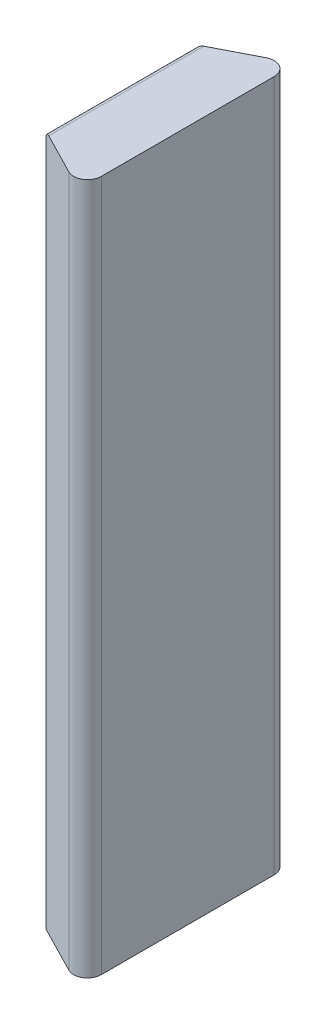
ISO-10303-21;
HEADER;
FILE_DESCRIPTION(('STEP AP214'),'2;1');
FILE_NAME('part.step','',(''),(''),'','','');
FILE_SCHEMA(('AUTOMOTIVE_DESIGN { 1 0 10303 214 1 1 1 1 }'));
ENDSEC;
DATA;
#1=APPLICATION_CONTEXT('core data for automotive mechanical design processes');
#2=APPLICATION_PROTOCOL_DEFINITION('international standard','automotive_design',2000,#1);
#3=PRODUCT_CONTEXT('',#1,'mechanical');
#4=PRODUCT('Part','Part','',(#3));
#5=PRODUCT_RELATED_PRODUCT_CATEGORY('part','',(#4));
#6=PRODUCT_DEFINITION_FORMATION('','',#4);
#7=PRODUCT_DEFINITION_CONTEXT('part definition',#1,'design');
#8=PRODUCT_DEFINITION('design','',#6,#7);
#9=PRODUCT_DEFINITION_SHAPE('','',#8);
#10=(LENGTH_UNIT() NAMED_UNIT(*) SI_UNIT(.MILLI.,.METRE.));
#11=(NAMED_UNIT(*) PLANE_ANGLE_UNIT() SI_UNIT($,.RADIAN.));
#12=(NAMED_UNIT(*) SI_UNIT($,.STERADIAN.) SOLID_ANGLE_UNIT());
#13=UNCERTAINTY_MEASURE_WITH_UNIT(LENGTH_MEASURE(1.E-05),#10,'distance_accuracy_value','');
#14=(GEOMETRIC_REPRESENTATION_CONTEXT(3) GLOBAL_UNCERTAINTY_ASSIGNED_CONTEXT((#13)) GLOBAL_UNIT_ASSIGNED_CONTEXT((#10,
#11,#12)) REPRESENTATION_CONTEXT('',''));
#15=CARTESIAN_POINT('',(0.,0.,0.));
#16=DIRECTION('',(0.,0.,1.));
#17=DIRECTION('',(1.,0.,0.));
#18=AXIS2_PLACEMENT_3D('',#15,#16,#17);
#19=CARTESIAN_POINT('',(0.399999999999999,24.6,134.));
#20=DIRECTION('',(0.,0.,-1.));
#21=DIRECTION('',(1.,0.,0.));
#22=AXIS2_PLACEMENT_3D('',#19,#20,#21);
#23=CYLINDRICAL_SURFACE('',#22,0.4);
#24=CARTESIAN_POINT('',(0.399999999999999,24.6,86.6089510744199));
#25=DIRECTION('',(0.456970406774729,0.,-0.889481898259959));
#26=DIRECTION('',(-0.889481898259958,0.,-0.456970406774729));
#27=AXIS2_PLACEMENT_3D('',#24,#25,#26);
#28=ELLIPSE('',#27,0.449699989153795,0.4);
#29=CARTESIAN_POINT('',(0.399999999999999,25.,86.6089510744199));
#30=VERTEX_POINT('',#29);
#31=CARTESIAN_POINT('',(0.,24.6,86.4034514874497));
#32=VERTEX_POINT('',#31);
#33=EDGE_CURVE('E379',#30,#32,#28,.F.);
#34=ORIENTED_EDGE('',*,*,#33,.F.);
#35=DIRECTION('',(0.,0.,-1.));
#36=VECTOR('',#35,1.);
#37=CARTESIAN_POINT('',(0.399999999999999,25.,134.));
#38=LINE('',#37,#36);
#39=CARTESIAN_POINT('',(0.399999999999999,25.,75.3910489255801));
#40=VERTEX_POINT('',#39);
#41=EDGE_CURVE('E382',#30,#40,#38,.T.);
#42=ORIENTED_EDGE('',*,*,#41,.T.);
#43=CARTESIAN_POINT('',(0.399999999999999,24.6,75.3910489255801));
#44=DIRECTION('',(0.456970406774729,0.,0.889481898259959));
#45=DIRECTION('',(-0.889481898259959,0.,0.456970406774729));
#46=AXIS2_PLACEMENT_3D('',#43,#44,#45);
#47=ELLIPSE('',#46,0.449699989153795,0.4);
#48=CARTESIAN_POINT('',(0.,24.6,75.5965485125503));
#49=VERTEX_POINT('',#48);
#50=EDGE_CURVE('E344',#49,#40,#47,.F.);
#51=ORIENTED_EDGE('',*,*,#50,.F.);
#52=DIRECTION('',(0.,0.,-1.));
#53=VECTOR('',#52,1.);
#54=CARTESIAN_POINT('',(0.,24.6,134.));
#55=LINE('',#54,#53);
#56=EDGE_CURVE('E384',#49,#32,#55,.F.);
#57=ORIENTED_EDGE('',*,*,#56,.T.);
#58=EDGE_LOOP('',(#34,#42,#51,#57));
#59=FACE_BOUND('',#58,.T.);
#60=ADVANCED_FACE('F277',(#59),#23,.T.);
#61=CARTESIAN_POINT('',(10.,25.,134.));
#62=DIRECTION('',(0.,-1.,0.));
#63=DIRECTION('',(0.,0.,1.));
#64=AXIS2_PLACEMENT_3D('',#61,#62,#63);
#65=PLANE('',#64);
#66=ORIENTED_EDGE('',*,*,#41,.F.);
#67=DIRECTION('',(0.889481898259958,0.,0.456970406774729));
#68=VECTOR('',#67,1.);
#69=CARTESIAN_POINT('',(27.2582022295512,25.,100.407324736757));
#70=LINE('',#69,#68);
#71=CARTESIAN_POINT('',(3.38363041453297,25.,88.1417881190656));
#72=VERTEX_POINT('',#71);
#73=EDGE_CURVE('E299',#30,#72,#70,.T.);
#74=ORIENTED_EDGE('',*,*,#73,.T.);
#75=CARTESIAN_POINT('',(3.84060082130771,25.,87.2523062208056));
#76=DIRECTION('',(0.,-1.,0.));
#77=DIRECTION('',(0.,0.,-1.));
#78=AXIS2_PLACEMENT_3D('',#75,#76,#77);
#79=CIRCLE('',#78,0.999999999999999);
#80=CARTESIAN_POINT('',(4.84060082130771,25.,87.2523062208056));
#81=VERTEX_POINT('',#80);
#82=EDGE_CURVE('E377',#72,#81,#79,.F.);
#83=ORIENTED_EDGE('',*,*,#82,.T.);
#84=DIRECTION('',(0.,0.,-1.));
#85=VECTOR('',#84,1.);
#86=CARTESIAN_POINT('',(4.84060082130771,25.,134.));
#87=LINE('',#86,#85);
#88=CARTESIAN_POINT('',(4.84060082130771,25.,74.7476937791944));
#89=VERTEX_POINT('',#88);
#90=EDGE_CURVE('E363',#81,#89,#87,.T.);
#91=ORIENTED_EDGE('',*,*,#90,.T.);
#92=CARTESIAN_POINT('',(3.84060082130771,25.,74.7476937791943));
#93=DIRECTION('',(0.,-1.,0.));
#94=DIRECTION('',(0.,0.,-1.));
#95=AXIS2_PLACEMENT_3D('',#92,#93,#94);
#96=CIRCLE('',#95,0.999999999999999);
#97=CARTESIAN_POINT('',(3.38363041453297,25.,73.8582118809344));
#98=VERTEX_POINT('',#97);
#99=EDGE_CURVE('E348',#89,#98,#96,.F.);
#100=ORIENTED_EDGE('',*,*,#99,.T.);
#101=DIRECTION('',(-0.889481898259959,0.,0.456970406774729));
#102=VECTOR('',#101,1.);
#103=CARTESIAN_POINT('',(27.2582022295512,25.,61.5926752632428));
#104=LINE('',#103,#102);
#105=EDGE_CURVE('E336',#98,#40,#104,.T.);
#106=ORIENTED_EDGE('',*,*,#105,.T.);
#107=EDGE_LOOP('',(#66,#74,#83,#91,#100,#106));
#108=FACE_BOUND('',#107,.T.);
#109=ADVANCED_FACE('F361',(#108),#65,.F.);
#110=CARTESIAN_POINT('',(0.,-24.99,0.));
#111=DIRECTION('',(0.,1.,0.));
#112=DIRECTION('',(0.,0.,1.));
#113=AXIS2_PLACEMENT_3D('',#110,#111,#112);
#114=PLANE('',#113);
#115=CARTESIAN_POINT('',(3.84060082130771,-24.99,87.2523062208056));
#116=DIRECTION('',(0.,1.,0.));
#117=DIRECTION('',(0.,0.,1.));
#118=AXIS2_PLACEMENT_3D('',#115,#116,#117);
#119=CIRCLE('',#118,0.999999999999999);
#120=CARTESIAN_POINT('',(4.84060082130771,-24.99,87.2523062208056));
#121=VERTEX_POINT('',#120);
#122=CARTESIAN_POINT('',(3.38363041453297,-24.99,88.1417881190656));
#123=VERTEX_POINT('',#122);
#124=EDGE_CURVE('E284',#121,#123,#119,.F.);
#125=ORIENTED_EDGE('',*,*,#124,.T.);
#126=DIRECTION('',(-0.889481898259958,0.,-0.456970406774729));
#127=VECTOR('',#126,1.);
#128=CARTESIAN_POINT('',(-35.1201434958961,-24.99,68.3605140305977));
#129=LINE('',#128,#127);
#130=CARTESIAN_POINT('',(0.,-24.99,86.4034514874497));
#131=VERTEX_POINT('',#130);
#132=EDGE_CURVE('E12',#123,#131,#129,.T.);
#133=ORIENTED_EDGE('',*,*,#132,.T.);
#134=DIRECTION('',(0.,0.,1.));
#135=VECTOR('',#134,1.);
#136=CARTESIAN_POINT('',(0.,-24.99,134.));
#137=LINE('',#136,#135);
#138=CARTESIAN_POINT('',(0.,-24.99,75.5965485125502));
#139=VERTEX_POINT('',#138);
#140=EDGE_CURVE('E387',#139,#131,#137,.T.);
#141=ORIENTED_EDGE('',*,*,#140,.F.);
#142=DIRECTION('',(0.889481898259959,0.,-0.456970406774729));
#143=VECTOR('',#142,1.);
#144=CARTESIAN_POINT('',(30.7274950924949,-24.99,59.8103296372088));
#145=LINE('',#144,#143);
#146=CARTESIAN_POINT('',(3.38363041453297,-24.99,73.8582118809344));
#147=VERTEX_POINT('',#146);
#148=EDGE_CURVE('E364',#139,#147,#145,.T.);
#149=ORIENTED_EDGE('',*,*,#148,.T.);
#150=CARTESIAN_POINT('',(3.84060082130771,-24.99,74.7476937791943));
#151=DIRECTION('',(0.,1.,0.));
#152=DIRECTION('',(0.,0.,1.));
#153=AXIS2_PLACEMENT_3D('',#150,#151,#152);
#154=CIRCLE('',#153,0.999999999999999);
#155=CARTESIAN_POINT('',(4.84060082130771,-24.99,74.7476937791944));
#156=VERTEX_POINT('',#155);
#157=EDGE_CURVE('E356',#147,#156,#154,.F.);
#158=ORIENTED_EDGE('',*,*,#157,.T.);
#159=DIRECTION('',(0.,0.,1.));
#160=VECTOR('',#159,1.);
#161=CARTESIAN_POINT('',(4.84060082130771,-24.99,0.));
#162=LINE('',#161,#160);
#163=EDGE_CURVE('E390',#156,#121,#162,.T.);
#164=ORIENTED_EDGE('',*,*,#163,.T.);
#165=EDGE_LOOP('',(#125,#133,#141,#149,#158,#164));
#166=FACE_BOUND('',#165,.T.);
#167=ADVANCED_FACE('F394',(#166),#114,.F.);
#168=CARTESIAN_POINT('',(0.,19.,134.));
#169=DIRECTION('',(1.,0.,0.));
#170=DIRECTION('',(0.,0.,1.));
#171=AXIS2_PLACEMENT_3D('',#168,#169,#170);
#172=PLANE('',#171);
#173=ORIENTED_EDGE('',*,*,#140,.T.);
#174=DIRECTION('',(0.,-1.,0.));
#175=VECTOR('',#174,1.);
#176=CARTESIAN_POINT('',(0.,30.,86.4034514874497));
#177=LINE('',#176,#175);
#178=EDGE_CURVE('E374',#32,#131,#177,.T.);
#179=ORIENTED_EDGE('',*,*,#178,.F.);
#180=ORIENTED_EDGE('',*,*,#56,.F.);
#181=DIRECTION('',(0.,-1.,0.));
#182=VECTOR('',#181,1.);
#183=CARTESIAN_POINT('',(0.,30.,75.5965485125502));
#184=LINE('',#183,#182);
#185=EDGE_CURVE('E359',#49,#139,#184,.T.);
#186=ORIENTED_EDGE('',*,*,#185,.T.);
#187=EDGE_LOOP('',(#173,#179,#180,#186));
#188=FACE_BOUND('',#187,.T.);
#189=ADVANCED_FACE('F401',(#188),#172,.F.);
#190=CARTESIAN_POINT('',(4.84060082130771,30.,74.7476937791944));
#191=DIRECTION('',(-1.,0.,0.));
#192=DIRECTION('',(0.,0.,1.));
#193=AXIS2_PLACEMENT_3D('',#190,#191,#192);
#194=PLANE('',#193);
#195=DIRECTION('',(0.,-1.,0.));
#196=VECTOR('',#195,1.);
#197=CARTESIAN_POINT('',(4.84060082130771,30.,87.2523062208056));
#198=LINE('',#197,#196);
#199=EDGE_CURVE('E291',#81,#121,#198,.T.);
#200=ORIENTED_EDGE('',*,*,#199,.T.);
#201=ORIENTED_EDGE('',*,*,#163,.F.);
#202=DIRECTION('',(0.,-1.,0.));
#203=VECTOR('',#202,1.);
#204=CARTESIAN_POINT('',(4.84060082130771,30.,74.7476937791944));
#205=LINE('',#204,#203);
#206=EDGE_CURVE('E358',#89,#156,#205,.T.);
#207=ORIENTED_EDGE('',*,*,#206,.F.);
#208=ORIENTED_EDGE('',*,*,#90,.F.);
#209=EDGE_LOOP('',(#200,#201,#207,#208));
#210=FACE_BOUND('',#209,.T.);
#211=ADVANCED_FACE('F405',(#210),#194,.F.);
#212=CARTESIAN_POINT('',(3.84060082130771,30.,87.2523062208056));
#213=DIRECTION('',(0.,-1.,0.));
#214=DIRECTION('',(0.,0.,-1.));
#215=AXIS2_PLACEMENT_3D('',#212,#213,#214);
#216=CYLINDRICAL_SURFACE('',#215,0.999999999999999);
#217=DIRECTION('',(0.,-1.,0.));
#218=VECTOR('',#217,1.);
#219=CARTESIAN_POINT('',(3.38363041453297,30.,88.1417881190656));
#220=LINE('',#219,#218);
#221=EDGE_CURVE('E371',#72,#123,#220,.T.);
#222=ORIENTED_EDGE('',*,*,#221,.T.);
#223=ORIENTED_EDGE('',*,*,#124,.F.);
#224=ORIENTED_EDGE('',*,*,#199,.F.);
#225=ORIENTED_EDGE('',*,*,#82,.F.);
#226=EDGE_LOOP('',(#222,#223,#224,#225));
#227=FACE_BOUND('',#226,.T.);
#228=ADVANCED_FACE('F396',(#227),#216,.T.);
#229=CARTESIAN_POINT('',(0.,30.,86.4034514874497));
#230=DIRECTION('',(0.456970406774729,0.,-0.889481898259959));
#231=DIRECTION('',(-0.889481898259958,0.,-0.456970406774729));
#232=AXIS2_PLACEMENT_3D('',#229,#230,#231);
#233=PLANE('',#232);
#234=ORIENTED_EDGE('',*,*,#33,.T.);
#235=ORIENTED_EDGE('',*,*,#178,.T.);
#236=ORIENTED_EDGE('',*,*,#132,.F.);
#237=ORIENTED_EDGE('',*,*,#221,.F.);
#238=ORIENTED_EDGE('',*,*,#73,.F.);
#239=EDGE_LOOP('',(#234,#235,#236,#237,#238));
#240=FACE_BOUND('',#239,.T.);
#241=ADVANCED_FACE('F397',(#240),#233,.F.);
#242=CARTESIAN_POINT('',(0.,30.,75.5965485125502));
#243=DIRECTION('',(0.456970406774729,0.,0.889481898259959));
#244=DIRECTION('',(0.889481898259959,0.,-0.456970406774729));
#245=AXIS2_PLACEMENT_3D('',#242,#243,#244);
#246=PLANE('',#245);
#247=DIRECTION('',(0.,-1.,0.));
#248=VECTOR('',#247,1.);
#249=CARTESIAN_POINT('',(3.38363041453297,30.,73.8582118809344));
#250=LINE('',#249,#248);
#251=EDGE_CURVE('E340',#98,#147,#250,.T.);
#252=ORIENTED_EDGE('',*,*,#251,.T.);
#253=ORIENTED_EDGE('',*,*,#148,.F.);
#254=ORIENTED_EDGE('',*,*,#185,.F.);
#255=ORIENTED_EDGE('',*,*,#50,.T.);
#256=ORIENTED_EDGE('',*,*,#105,.F.);
#257=EDGE_LOOP('',(#252,#253,#254,#255,#256));
#258=FACE_BOUND('',#257,.T.);
#259=ADVANCED_FACE('F338',(#258),#246,.F.);
#260=CARTESIAN_POINT('',(3.84060082130771,30.,74.7476937791943));
#261=DIRECTION('',(0.,-1.,0.));
#262=DIRECTION('',(0.,0.,-1.));
#263=AXIS2_PLACEMENT_3D('',#260,#261,#262);
#264=CYLINDRICAL_SURFACE('',#263,0.999999999999999);
#265=ORIENTED_EDGE('',*,*,#206,.T.);
#266=ORIENTED_EDGE('',*,*,#157,.F.);
#267=ORIENTED_EDGE('',*,*,#251,.F.);
#268=ORIENTED_EDGE('',*,*,#99,.F.);
#269=EDGE_LOOP('',(#265,#266,#267,#268));
#270=FACE_BOUND('',#269,.T.);
#271=ADVANCED_FACE('F353',(#270),#264,.T.);
#272=CLOSED_SHELL('',(#60,#109,#167,#189,#211,#228,#241,#259,#271));
#273=MANIFOLD_SOLID_BREP('B2',#272);
#274=ADVANCED_BREP_SHAPE_REPRESENTATION('',(#18,#273),#14);
#275=SHAPE_DEFINITION_REPRESENTATION(#9,#274);
ENDSEC;
END-ISO-10303-21;
